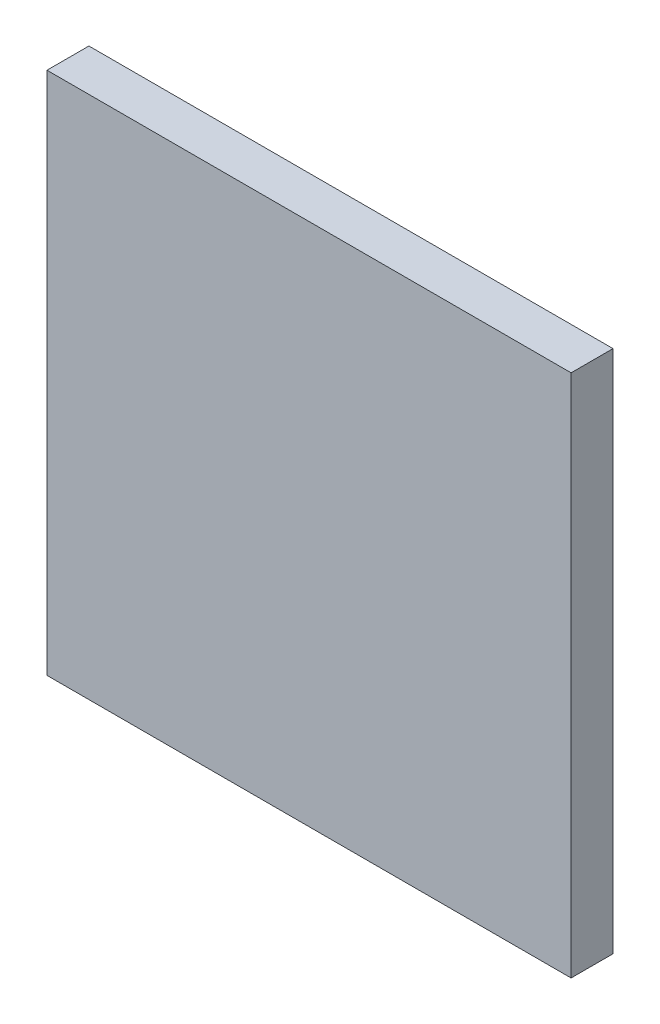
ISO-10303-21;
HEADER;
FILE_DESCRIPTION(('STEP AP214'),'2;1');
FILE_NAME('part.step','',(''),(''),'','','');
FILE_SCHEMA(('AUTOMOTIVE_DESIGN { 1 0 10303 214 1 1 1 1 }'));
ENDSEC;
DATA;
#1=APPLICATION_CONTEXT('core data for automotive mechanical design processes');
#2=APPLICATION_PROTOCOL_DEFINITION('international standard','automotive_design',2000,#1);
#3=PRODUCT_CONTEXT('',#1,'mechanical');
#4=PRODUCT('Part','Part','',(#3));
#5=PRODUCT_RELATED_PRODUCT_CATEGORY('part','',(#4));
#6=PRODUCT_DEFINITION_FORMATION('','',#4);
#7=PRODUCT_DEFINITION_CONTEXT('part definition',#1,'design');
#8=PRODUCT_DEFINITION('design','',#6,#7);
#9=PRODUCT_DEFINITION_SHAPE('','',#8);
#10=(LENGTH_UNIT() NAMED_UNIT(*) SI_UNIT(.MILLI.,.METRE.));
#11=(NAMED_UNIT(*) PLANE_ANGLE_UNIT() SI_UNIT($,.RADIAN.));
#12=(NAMED_UNIT(*) SI_UNIT($,.STERADIAN.) SOLID_ANGLE_UNIT());
#13=UNCERTAINTY_MEASURE_WITH_UNIT(LENGTH_MEASURE(1.E-05),#10,'distance_accuracy_value','');
#14=(GEOMETRIC_REPRESENTATION_CONTEXT(3) GLOBAL_UNCERTAINTY_ASSIGNED_CONTEXT((#13)) GLOBAL_UNIT_ASSIGNED_CONTEXT((#10,
#11,#12)) REPRESENTATION_CONTEXT('',''));
#15=CARTESIAN_POINT('',(0.,0.,0.));
#16=DIRECTION('',(0.,0.,1.));
#17=DIRECTION('',(1.,0.,0.));
#18=AXIS2_PLACEMENT_3D('',#15,#16,#17);
#19=CARTESIAN_POINT('',(0.,25.,2.));
#20=DIRECTION('',(0.,1.,0.));
#21=DIRECTION('',(0.,0.,1.));
#22=AXIS2_PLACEMENT_3D('',#19,#20,#21);
#23=PLANE('',#22);
#24=DIRECTION('',(1.,0.,0.));
#25=VECTOR('',#24,1.);
#26=CARTESIAN_POINT('',(0.,25.,0.));
#27=LINE('',#26,#25);
#28=CARTESIAN_POINT('',(0.,25.,0.));
#29=VERTEX_POINT('',#28);
#30=CARTESIAN_POINT('',(25.,25.,0.));
#31=VERTEX_POINT('',#30);
#32=EDGE_CURVE('E97',#29,#31,#27,.T.);
#33=ORIENTED_EDGE('',*,*,#32,.F.);
#34=DIRECTION('',(0.,0.,-1.));
#35=VECTOR('',#34,1.);
#36=CARTESIAN_POINT('',(0.,25.,2.));
#37=LINE('',#36,#35);
#38=CARTESIAN_POINT('',(0.,25.,2.));
#39=VERTEX_POINT('',#38);
#40=EDGE_CURVE('E11',#39,#29,#37,.T.);
#41=ORIENTED_EDGE('',*,*,#40,.F.);
#42=DIRECTION('',(1.,0.,0.));
#43=VECTOR('',#42,1.);
#44=CARTESIAN_POINT('',(0.,25.,2.));
#45=LINE('',#44,#43);
#46=CARTESIAN_POINT('',(25.,25.,2.));
#47=VERTEX_POINT('',#46);
#48=EDGE_CURVE('E91',#39,#47,#45,.T.);
#49=ORIENTED_EDGE('',*,*,#48,.T.);
#50=DIRECTION('',(0.,0.,-1.));
#51=VECTOR('',#50,1.);
#52=CARTESIAN_POINT('',(25.,25.,2.));
#53=LINE('',#52,#51);
#54=EDGE_CURVE('E36',#47,#31,#53,.T.);
#55=ORIENTED_EDGE('',*,*,#54,.T.);
#56=EDGE_LOOP('',(#33,#41,#49,#55));
#57=FACE_BOUND('',#56,.T.);
#58=ADVANCED_FACE('F33',(#57),#23,.T.);
#59=CARTESIAN_POINT('',(0.,0.,2.));
#60=DIRECTION('',(-1.,0.,0.));
#61=DIRECTION('',(0.,0.,1.));
#62=AXIS2_PLACEMENT_3D('',#59,#60,#61);
#63=PLANE('',#62);
#64=DIRECTION('',(0.,1.,0.));
#65=VECTOR('',#64,1.);
#66=CARTESIAN_POINT('',(0.,0.,0.));
#67=LINE('',#66,#65);
#68=CARTESIAN_POINT('',(0.,0.,0.));
#69=VERTEX_POINT('',#68);
#70=EDGE_CURVE('E93',#69,#29,#67,.T.);
#71=ORIENTED_EDGE('',*,*,#70,.F.);
#72=DIRECTION('',(0.,0.,-1.));
#73=VECTOR('',#72,1.);
#74=CARTESIAN_POINT('',(0.,0.,2.));
#75=LINE('',#74,#73);
#76=CARTESIAN_POINT('',(0.,0.,2.));
#77=VERTEX_POINT('',#76);
#78=EDGE_CURVE('E42',#77,#69,#75,.T.);
#79=ORIENTED_EDGE('',*,*,#78,.F.);
#80=DIRECTION('',(0.,1.,0.));
#81=VECTOR('',#80,1.);
#82=CARTESIAN_POINT('',(0.,0.,2.));
#83=LINE('',#82,#81);
#84=EDGE_CURVE('E81',#77,#39,#83,.T.);
#85=ORIENTED_EDGE('',*,*,#84,.T.);
#86=ORIENTED_EDGE('',*,*,#40,.T.);
#87=EDGE_LOOP('',(#71,#79,#85,#86));
#88=FACE_BOUND('',#87,.T.);
#89=ADVANCED_FACE('F107',(#88),#63,.T.);
#90=CARTESIAN_POINT('',(0.,0.,2.));
#91=DIRECTION('',(0.,1.,0.));
#92=DIRECTION('',(0.,0.,1.));
#93=AXIS2_PLACEMENT_3D('',#90,#91,#92);
#94=PLANE('',#93);
#95=DIRECTION('',(1.,0.,0.));
#96=VECTOR('',#95,1.);
#97=CARTESIAN_POINT('',(0.,0.,0.));
#98=LINE('',#97,#96);
#99=CARTESIAN_POINT('',(25.,0.,0.));
#100=VERTEX_POINT('',#99);
#101=EDGE_CURVE('E86',#69,#100,#98,.T.);
#102=ORIENTED_EDGE('',*,*,#101,.T.);
#103=DIRECTION('',(0.,0.,-1.));
#104=VECTOR('',#103,1.);
#105=CARTESIAN_POINT('',(25.,0.,2.));
#106=LINE('',#105,#104);
#107=CARTESIAN_POINT('',(25.,0.,2.));
#108=VERTEX_POINT('',#107);
#109=EDGE_CURVE('E84',#108,#100,#106,.T.);
#110=ORIENTED_EDGE('',*,*,#109,.F.);
#111=DIRECTION('',(1.,0.,0.));
#112=VECTOR('',#111,1.);
#113=CARTESIAN_POINT('',(0.,0.,2.));
#114=LINE('',#113,#112);
#115=EDGE_CURVE('E78',#77,#108,#114,.T.);
#116=ORIENTED_EDGE('',*,*,#115,.F.);
#117=ORIENTED_EDGE('',*,*,#78,.T.);
#118=EDGE_LOOP('',(#102,#110,#116,#117));
#119=FACE_BOUND('',#118,.T.);
#120=ADVANCED_FACE('F85',(#119),#94,.F.);
#121=CARTESIAN_POINT('',(25.,0.,2.));
#122=DIRECTION('',(-1.,0.,0.));
#123=DIRECTION('',(0.,0.,1.));
#124=AXIS2_PLACEMENT_3D('',#121,#122,#123);
#125=PLANE('',#124);
#126=DIRECTION('',(0.,1.,0.));
#127=VECTOR('',#126,1.);
#128=CARTESIAN_POINT('',(25.,0.,0.));
#129=LINE('',#128,#127);
#130=EDGE_CURVE('E100',#100,#31,#129,.T.);
#131=ORIENTED_EDGE('',*,*,#130,.T.);
#132=ORIENTED_EDGE('',*,*,#54,.F.);
#133=DIRECTION('',(0.,1.,0.));
#134=VECTOR('',#133,1.);
#135=CARTESIAN_POINT('',(25.,0.,2.));
#136=LINE('',#135,#134);
#137=EDGE_CURVE('E75',#108,#47,#136,.T.);
#138=ORIENTED_EDGE('',*,*,#137,.F.);
#139=ORIENTED_EDGE('',*,*,#109,.T.);
#140=EDGE_LOOP('',(#131,#132,#138,#139));
#141=FACE_BOUND('',#140,.T.);
#142=ADVANCED_FACE('F90',(#141),#125,.F.);
#143=CARTESIAN_POINT('',(0.,0.,2.));
#144=DIRECTION('',(0.,0.,1.));
#145=DIRECTION('',(1.,0.,0.));
#146=AXIS2_PLACEMENT_3D('',#143,#144,#145);
#147=PLANE('',#146);
#148=ORIENTED_EDGE('',*,*,#48,.F.);
#149=ORIENTED_EDGE('',*,*,#84,.F.);
#150=ORIENTED_EDGE('',*,*,#115,.T.);
#151=ORIENTED_EDGE('',*,*,#137,.T.);
#152=EDGE_LOOP('',(#148,#149,#150,#151));
#153=FACE_BOUND('',#152,.T.);
#154=ADVANCED_FACE('F80',(#153),#147,.T.);
#155=CARTESIAN_POINT('',(0.,0.,0.));
#156=DIRECTION('',(0.,0.,1.));
#157=DIRECTION('',(1.,0.,0.));
#158=AXIS2_PLACEMENT_3D('',#155,#156,#157);
#159=PLANE('',#158);
#160=ORIENTED_EDGE('',*,*,#32,.T.);
#161=ORIENTED_EDGE('',*,*,#130,.F.);
#162=ORIENTED_EDGE('',*,*,#101,.F.);
#163=ORIENTED_EDGE('',*,*,#70,.T.);
#164=EDGE_LOOP('',(#160,#161,#162,#163));
#165=FACE_BOUND('',#164,.T.);
#166=ADVANCED_FACE('F106',(#165),#159,.F.);
#167=CLOSED_SHELL('',(#58,#89,#120,#142,#154,#166));
#168=MANIFOLD_SOLID_BREP('B2',#167);
#169=ADVANCED_BREP_SHAPE_REPRESENTATION('',(#18,#168),#14);
#170=SHAPE_DEFINITION_REPRESENTATION(#9,#169);
ENDSEC;
END-ISO-10303-21;
